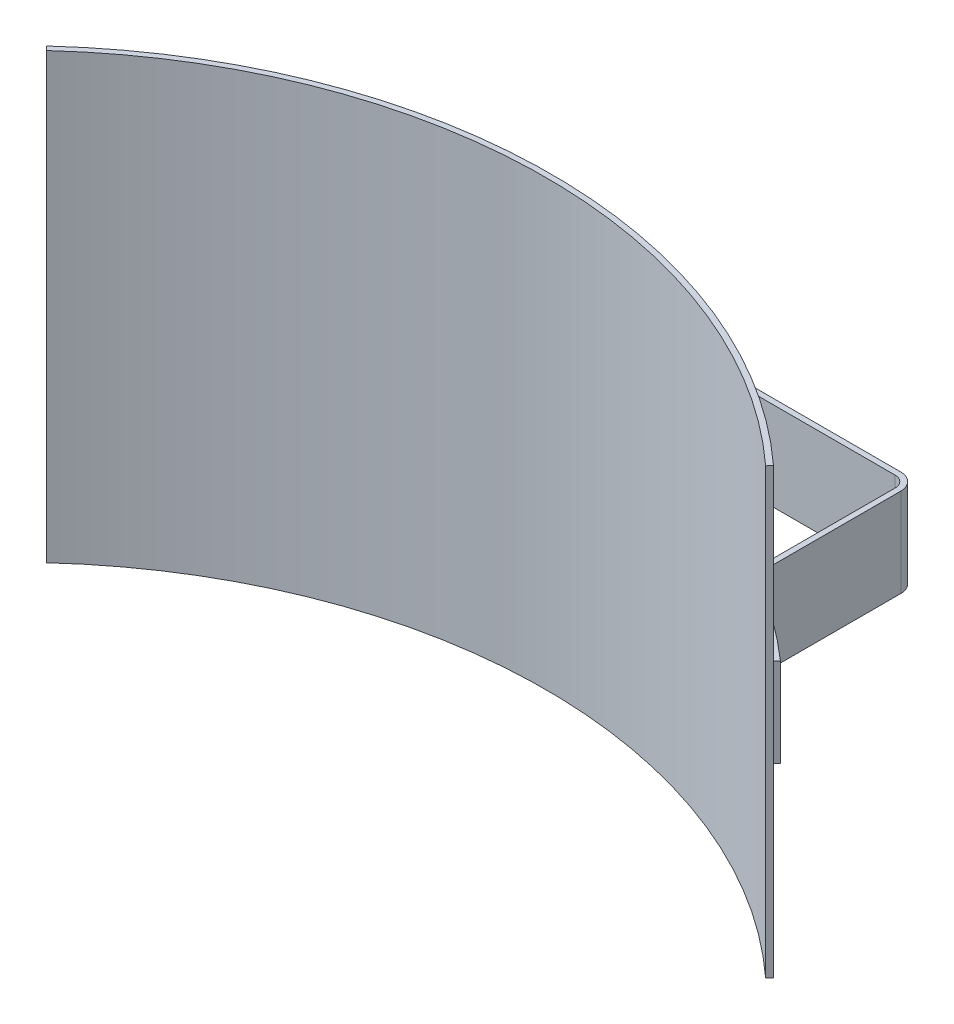
ISO-10303-21;
HEADER;
FILE_DESCRIPTION(('STEP AP214'),'2;1');
FILE_NAME('part.step','',(''),(''),'','','');
FILE_SCHEMA(('AUTOMOTIVE_DESIGN { 1 0 10303 214 1 1 1 1 }'));
ENDSEC;
DATA;
#1=APPLICATION_CONTEXT('core data for automotive mechanical design processes');
#2=APPLICATION_PROTOCOL_DEFINITION('international standard','automotive_design',2000,#1);
#3=PRODUCT_CONTEXT('',#1,'mechanical');
#4=PRODUCT('Part','Part','',(#3));
#5=PRODUCT_RELATED_PRODUCT_CATEGORY('part','',(#4));
#6=PRODUCT_DEFINITION_FORMATION('','',#4);
#7=PRODUCT_DEFINITION_CONTEXT('part definition',#1,'design');
#8=PRODUCT_DEFINITION('design','',#6,#7);
#9=PRODUCT_DEFINITION_SHAPE('','',#8);
#10=(LENGTH_UNIT() NAMED_UNIT(*) SI_UNIT(.MILLI.,.METRE.));
#11=(NAMED_UNIT(*) PLANE_ANGLE_UNIT() SI_UNIT($,.RADIAN.));
#12=(NAMED_UNIT(*) SI_UNIT($,.STERADIAN.) SOLID_ANGLE_UNIT());
#13=UNCERTAINTY_MEASURE_WITH_UNIT(LENGTH_MEASURE(1.E-05),#10,'distance_accuracy_value','');
#14=(GEOMETRIC_REPRESENTATION_CONTEXT(3) GLOBAL_UNCERTAINTY_ASSIGNED_CONTEXT((#13)) GLOBAL_UNIT_ASSIGNED_CONTEXT((#10,
#11,#12)) REPRESENTATION_CONTEXT('',''));
#15=CARTESIAN_POINT('',(0.,0.,0.));
#16=DIRECTION('',(0.,0.,1.));
#17=DIRECTION('',(1.,0.,0.));
#18=AXIS2_PLACEMENT_3D('',#15,#16,#17);
#19=CARTESIAN_POINT('',(0.,63.5,0.));
#20=DIRECTION('',(0.,-1.,0.));
#21=DIRECTION('',(0.,0.,-1.));
#22=AXIS2_PLACEMENT_3D('',#19,#20,#21);
#23=CYLINDRICAL_SURFACE('',#22,153.9875);
#24=DIRECTION('',(0.,-1.,0.));
#25=VECTOR('',#24,1.);
#26=CARTESIAN_POINT('',(101.6,12.7,-115.713396615301));
#27=LINE('',#26,#25);
#28=CARTESIAN_POINT('',(101.6,12.7,-115.713396615301));
#29=VERTEX_POINT('',#28);
#30=CARTESIAN_POINT('',(101.6,-12.7,-115.713396615301));
#31=VERTEX_POINT('',#30);
#32=EDGE_CURVE('E54',#29,#31,#27,.T.);
#33=ORIENTED_EDGE('',*,*,#32,.F.);
#34=CARTESIAN_POINT('',(0.,12.7,0.));
#35=DIRECTION('',(0.,-1.,0.));
#36=DIRECTION('',(0.,0.,-1.));
#37=AXIS2_PLACEMENT_3D('',#34,#35,#36);
#38=CIRCLE('',#37,153.9875);
#39=CARTESIAN_POINT('',(77.7714646464647,12.7,-132.905039193379));
#40=VERTEX_POINT('',#39);
#41=EDGE_CURVE('E49',#40,#29,#38,.T.);
#42=ORIENTED_EDGE('',*,*,#41,.F.);
#43=DIRECTION('',(0.,-1.,0.));
#44=VECTOR('',#43,1.);
#45=CARTESIAN_POINT('',(77.7714646464646,12.7,-132.905039193379));
#46=LINE('',#45,#44);
#47=CARTESIAN_POINT('',(77.7714646464646,-12.7,-132.905039193379));
#48=VERTEX_POINT('',#47);
#49=EDGE_CURVE('E327',#40,#48,#46,.T.);
#50=ORIENTED_EDGE('',*,*,#49,.T.);
#51=CARTESIAN_POINT('',(0.,-12.7,0.));
#52=DIRECTION('',(0.,-1.,0.));
#53=DIRECTION('',(0.,0.,-1.));
#54=AXIS2_PLACEMENT_3D('',#51,#52,#53);
#55=CIRCLE('',#54,153.9875);
#56=EDGE_CURVE('E270',#48,#31,#55,.T.);
#57=ORIENTED_EDGE('',*,*,#56,.T.);
#58=EDGE_LOOP('',(#33,#42,#50,#57));
#59=FACE_BOUND('',#58,.T.);
#60=DIRECTION('',(0.,-1.,0.));
#61=VECTOR('',#60,1.);
#62=CARTESIAN_POINT('',(-77.7714646464646,12.7,-132.905039193379));
#63=LINE('',#62,#61);
#64=CARTESIAN_POINT('',(-77.7714646464647,12.7,-132.905039193379));
#65=VERTEX_POINT('',#64);
#66=CARTESIAN_POINT('',(-77.7714646464646,-12.7,-132.905039193379));
#67=VERTEX_POINT('',#66);
#68=EDGE_CURVE('E211',#65,#67,#63,.T.);
#69=ORIENTED_EDGE('',*,*,#68,.F.);
#70=CARTESIAN_POINT('',(0.,12.7,0.));
#71=DIRECTION('',(0.,-1.,0.));
#72=DIRECTION('',(0.,0.,1.));
#73=AXIS2_PLACEMENT_3D('',#70,#71,#72);
#74=CIRCLE('',#73,153.9875);
#75=CARTESIAN_POINT('',(-101.6,12.7,-115.713396615301));
#76=VERTEX_POINT('',#75);
#77=EDGE_CURVE('E200',#76,#65,#74,.T.);
#78=ORIENTED_EDGE('',*,*,#77,.F.);
#79=DIRECTION('',(0.,-1.,0.));
#80=VECTOR('',#79,1.);
#81=CARTESIAN_POINT('',(-101.6,12.7,-115.713396615301));
#82=LINE('',#81,#80);
#83=CARTESIAN_POINT('',(-101.6,-12.7,-115.713396615301));
#84=VERTEX_POINT('',#83);
#85=EDGE_CURVE('E253',#76,#84,#82,.T.);
#86=ORIENTED_EDGE('',*,*,#85,.T.);
#87=CARTESIAN_POINT('',(0.,-12.7,0.));
#88=DIRECTION('',(0.,-1.,0.));
#89=DIRECTION('',(0.,0.,1.));
#90=AXIS2_PLACEMENT_3D('',#87,#88,#89);
#91=CIRCLE('',#90,153.9875);
#92=EDGE_CURVE('E254',#84,#67,#91,.T.);
#93=ORIENTED_EDGE('',*,*,#92,.T.);
#94=EDGE_LOOP('',(#69,#78,#86,#93));
#95=FACE_BOUND('',#94,.T.);
#96=CARTESIAN_POINT('',(0.,-63.5,0.));
#97=DIRECTION('',(0.,1.,0.));
#98=DIRECTION('',(0.,0.,1.));
#99=AXIS2_PLACEMENT_3D('',#96,#97,#98);
#100=CIRCLE('',#99,153.9875);
#101=CARTESIAN_POINT('',(104.032447095217,-63.5,-113.531493902049));
#102=VERTEX_POINT('',#101);
#103=CARTESIAN_POINT('',(-104.032447095217,-63.5,-113.531493902049));
#104=VERTEX_POINT('',#103);
#105=EDGE_CURVE('E343',#102,#104,#100,.T.);
#106=ORIENTED_EDGE('',*,*,#105,.T.);
#107=DIRECTION('',(0.,-1.,0.));
#108=VECTOR('',#107,1.);
#109=CARTESIAN_POINT('',(-104.032447095217,63.5,-113.531493902049));
#110=LINE('',#109,#108);
#111=CARTESIAN_POINT('',(-104.032447095217,63.5,-113.531493902049));
#112=VERTEX_POINT('',#111);
#113=EDGE_CURVE('E11',#112,#104,#110,.T.);
#114=ORIENTED_EDGE('',*,*,#113,.F.);
#115=CARTESIAN_POINT('',(0.,63.5,0.));
#116=DIRECTION('',(0.,1.,0.));
#117=DIRECTION('',(0.,0.,1.));
#118=AXIS2_PLACEMENT_3D('',#115,#116,#117);
#119=CIRCLE('',#118,153.9875);
#120=CARTESIAN_POINT('',(104.032447095217,63.5,-113.531493902049));
#121=VERTEX_POINT('',#120);
#122=EDGE_CURVE('E344',#121,#112,#119,.T.);
#123=ORIENTED_EDGE('',*,*,#122,.F.);
#124=DIRECTION('',(0.,-1.,0.));
#125=VECTOR('',#124,1.);
#126=CARTESIAN_POINT('',(104.032447095217,63.5,-113.531493902049));
#127=LINE('',#126,#125);
#128=EDGE_CURVE('E354',#121,#102,#127,.T.);
#129=ORIENTED_EDGE('',*,*,#128,.T.);
#130=EDGE_LOOP('',(#106,#114,#123,#129));
#131=FACE_BOUND('',#130,.T.);
#132=ADVANCED_FACE('F35',(#59,#95,#131),#23,.T.);
#133=CARTESIAN_POINT('',(-104.032447095217,63.5,-113.531493902049));
#134=DIRECTION('',(0.73727733681012,0.,-0.675590207615665));
#135=DIRECTION('',(-0.675590207615665,0.,-0.73727733681012));
#136=AXIS2_PLACEMENT_3D('',#133,#134,#135);
#137=PLANE('',#136);
#138=DIRECTION('',(0.675590207615665,0.,0.73727733681012));
#139=VECTOR('',#138,1.);
#140=CARTESIAN_POINT('',(-104.032447095217,-63.5,-113.531493902049));
#141=LINE('',#140,#139);
#142=CARTESIAN_POINT('',(-102.959947640627,-63.5,-112.361066129863));
#143=VERTEX_POINT('',#142);
#144=EDGE_CURVE('E357',#104,#143,#141,.T.);
#145=ORIENTED_EDGE('',*,*,#144,.T.);
#146=DIRECTION('',(0.,-1.,0.));
#147=VECTOR('',#146,1.);
#148=CARTESIAN_POINT('',(-102.959947640627,63.5,-112.361066129863));
#149=LINE('',#148,#147);
#150=CARTESIAN_POINT('',(-102.959947640627,63.5,-112.361066129863));
#151=VERTEX_POINT('',#150);
#152=EDGE_CURVE('E42',#151,#143,#149,.T.);
#153=ORIENTED_EDGE('',*,*,#152,.F.);
#154=DIRECTION('',(0.675590207615665,0.,0.73727733681012));
#155=VECTOR('',#154,1.);
#156=CARTESIAN_POINT('',(-104.032447095217,63.5,-113.531493902049));
#157=LINE('',#156,#155);
#158=EDGE_CURVE('E347',#112,#151,#157,.T.);
#159=ORIENTED_EDGE('',*,*,#158,.F.);
#160=ORIENTED_EDGE('',*,*,#113,.T.);
#161=EDGE_LOOP('',(#145,#153,#159,#160));
#162=FACE_BOUND('',#161,.T.);
#163=ADVANCED_FACE('F387',(#162),#137,.F.);
#164=CARTESIAN_POINT('',(0.,63.5,0.));
#165=DIRECTION('',(0.,-1.,0.));
#166=DIRECTION('',(0.,0.,-1.));
#167=AXIS2_PLACEMENT_3D('',#164,#165,#166);
#168=CYLINDRICAL_SURFACE('',#167,152.4);
#169=CARTESIAN_POINT('',(0.,-63.5,0.));
#170=DIRECTION('',(0.,-1.,0.));
#171=DIRECTION('',(0.,0.,1.));
#172=AXIS2_PLACEMENT_3D('',#169,#170,#171);
#173=CIRCLE('',#172,152.4);
#174=CARTESIAN_POINT('',(102.959947640627,-63.5,-112.361066129863));
#175=VERTEX_POINT('',#174);
#176=EDGE_CURVE('E359',#143,#175,#173,.T.);
#177=ORIENTED_EDGE('',*,*,#176,.T.);
#178=DIRECTION('',(0.,-1.,0.));
#179=VECTOR('',#178,1.);
#180=CARTESIAN_POINT('',(102.959947640627,63.5,-112.361066129863));
#181=LINE('',#180,#179);
#182=CARTESIAN_POINT('',(102.959947640627,63.5,-112.361066129863));
#183=VERTEX_POINT('',#182);
#184=EDGE_CURVE('E364',#183,#175,#181,.T.);
#185=ORIENTED_EDGE('',*,*,#184,.F.);
#186=CARTESIAN_POINT('',(0.,63.5,0.));
#187=DIRECTION('',(0.,-1.,0.));
#188=DIRECTION('',(0.,0.,1.));
#189=AXIS2_PLACEMENT_3D('',#186,#187,#188);
#190=CIRCLE('',#189,152.4);
#191=EDGE_CURVE('E350',#151,#183,#190,.T.);
#192=ORIENTED_EDGE('',*,*,#191,.F.);
#193=ORIENTED_EDGE('',*,*,#152,.T.);
#194=EDGE_LOOP('',(#177,#185,#192,#193));
#195=FACE_BOUND('',#194,.T.);
#196=ADVANCED_FACE('F371',(#195),#168,.F.);
#197=CARTESIAN_POINT('',(104.032447095217,63.5,-113.531493902049));
#198=DIRECTION('',(-0.737277336810124,0.,-0.67559020761566));
#199=DIRECTION('',(-0.67559020761566,0.,0.737277336810124));
#200=AXIS2_PLACEMENT_3D('',#197,#198,#199);
#201=PLANE('',#200);
#202=DIRECTION('',(0.67559020761566,0.,-0.737277336810124));
#203=VECTOR('',#202,1.);
#204=CARTESIAN_POINT('',(104.032447095217,-63.5,-113.531493902049));
#205=LINE('',#204,#203);
#206=EDGE_CURVE('E348',#175,#102,#205,.T.);
#207=ORIENTED_EDGE('',*,*,#206,.T.);
#208=ORIENTED_EDGE('',*,*,#128,.F.);
#209=DIRECTION('',(0.67559020761566,0.,-0.737277336810124));
#210=VECTOR('',#209,1.);
#211=CARTESIAN_POINT('',(104.032447095217,63.5,-113.531493902049));
#212=LINE('',#211,#210);
#213=EDGE_CURVE('E352',#183,#121,#212,.T.);
#214=ORIENTED_EDGE('',*,*,#213,.F.);
#215=ORIENTED_EDGE('',*,*,#184,.T.);
#216=EDGE_LOOP('',(#207,#208,#214,#215));
#217=FACE_BOUND('',#216,.T.);
#218=ADVANCED_FACE('F380',(#217),#201,.F.);
#219=CARTESIAN_POINT('',(0.,63.5,0.));
#220=DIRECTION('',(0.,1.,0.));
#221=DIRECTION('',(0.,0.,1.));
#222=AXIS2_PLACEMENT_3D('',#219,#220,#221);
#223=PLANE('',#222);
#224=ORIENTED_EDGE('',*,*,#122,.T.);
#225=ORIENTED_EDGE('',*,*,#158,.T.);
#226=ORIENTED_EDGE('',*,*,#191,.T.);
#227=ORIENTED_EDGE('',*,*,#213,.T.);
#228=EDGE_LOOP('',(#224,#225,#226,#227));
#229=FACE_BOUND('',#228,.T.);
#230=ADVANCED_FACE('F386',(#229),#223,.T.);
#231=CARTESIAN_POINT('',(0.,-63.5,0.));
#232=DIRECTION('',(0.,1.,0.));
#233=DIRECTION('',(0.,0.,1.));
#234=AXIS2_PLACEMENT_3D('',#231,#232,#233);
#235=PLANE('',#234);
#236=ORIENTED_EDGE('',*,*,#105,.F.);
#237=ORIENTED_EDGE('',*,*,#206,.F.);
#238=ORIENTED_EDGE('',*,*,#176,.F.);
#239=ORIENTED_EDGE('',*,*,#144,.F.);
#240=EDGE_LOOP('',(#236,#237,#238,#239));
#241=FACE_BOUND('',#240,.T.);
#242=ADVANCED_FACE('F377',(#241),#235,.F.);
#243=CARTESIAN_POINT('',(-79.375,12.7,-135.645349279841));
#244=DIRECTION('',(0.,-1.,0.));
#245=DIRECTION('',(0.,0.,-1.));
#246=AXIS2_PLACEMENT_3D('',#243,#244,#245);
#247=CYLINDRICAL_SURFACE('',#246,3.17500000000001);
#248=CARTESIAN_POINT('',(-79.375,-12.7,-135.645349279841));
#249=DIRECTION('',(0.,1.,0.));
#250=DIRECTION('',(0.,0.,-1.));
#251=AXIS2_PLACEMENT_3D('',#248,#249,#250);
#252=CIRCLE('',#251,3.17500000000001);
#253=CARTESIAN_POINT('',(-76.2,-12.7,-135.645349279841));
#254=VERTEX_POINT('',#253);
#255=EDGE_CURVE('E208',#67,#254,#252,.T.);
#256=ORIENTED_EDGE('',*,*,#255,.T.);
#257=DIRECTION('',(0.,-1.,0.));
#258=VECTOR('',#257,1.);
#259=CARTESIAN_POINT('',(-76.2,12.7,-135.645349279841));
#260=LINE('',#259,#258);
#261=CARTESIAN_POINT('',(-76.2,12.7,-135.645349279841));
#262=VERTEX_POINT('',#261);
#263=EDGE_CURVE('E205',#262,#254,#260,.T.);
#264=ORIENTED_EDGE('',*,*,#263,.F.);
#265=CARTESIAN_POINT('',(-79.375,12.7,-135.645349279841));
#266=DIRECTION('',(0.,1.,0.));
#267=DIRECTION('',(0.,0.,-1.));
#268=AXIS2_PLACEMENT_3D('',#265,#266,#267);
#269=CIRCLE('',#268,3.17500000000001);
#270=EDGE_CURVE('E193',#65,#262,#269,.T.);
#271=ORIENTED_EDGE('',*,*,#270,.F.);
#272=ORIENTED_EDGE('',*,*,#68,.T.);
#273=EDGE_LOOP('',(#256,#264,#271,#272));
#274=FACE_BOUND('',#273,.T.);
#275=ADVANCED_FACE('F206',(#274),#247,.T.);
#276=CARTESIAN_POINT('',(-76.2,12.7,-176.2125));
#277=DIRECTION('',(-1.,0.,0.));
#278=DIRECTION('',(0.,0.,1.));
#279=AXIS2_PLACEMENT_3D('',#276,#277,#278);
#280=PLANE('',#279);
#281=DIRECTION('',(0.,0.,-1.));
#282=VECTOR('',#281,1.);
#283=CARTESIAN_POINT('',(-76.2,-12.7,-176.2125));
#284=LINE('',#283,#282);
#285=CARTESIAN_POINT('',(-76.2,-12.7,-176.2125));
#286=VERTEX_POINT('',#285);
#287=EDGE_CURVE('E257',#254,#286,#284,.T.);
#288=ORIENTED_EDGE('',*,*,#287,.T.);
#289=DIRECTION('',(0.,-1.,0.));
#290=VECTOR('',#289,1.);
#291=CARTESIAN_POINT('',(-76.2,12.7,-176.2125));
#292=LINE('',#291,#290);
#293=CARTESIAN_POINT('',(-76.2,12.7,-176.2125));
#294=VERTEX_POINT('',#293);
#295=EDGE_CURVE('E212',#294,#286,#292,.T.);
#296=ORIENTED_EDGE('',*,*,#295,.F.);
#297=DIRECTION('',(0.,0.,-1.));
#298=VECTOR('',#297,1.);
#299=CARTESIAN_POINT('',(-76.2,12.7,-176.2125));
#300=LINE('',#299,#298);
#301=EDGE_CURVE('E197',#262,#294,#300,.T.);
#302=ORIENTED_EDGE('',*,*,#301,.F.);
#303=ORIENTED_EDGE('',*,*,#263,.T.);
#304=EDGE_LOOP('',(#288,#296,#302,#303));
#305=FACE_BOUND('',#304,.T.);
#306=ADVANCED_FACE('F214',(#305),#280,.F.);
#307=CARTESIAN_POINT('',(-73.025,12.7,-176.2125));
#308=DIRECTION('',(0.,-1.,0.));
#309=DIRECTION('',(0.,0.,-1.));
#310=AXIS2_PLACEMENT_3D('',#307,#308,#309);
#311=CYLINDRICAL_SURFACE('',#310,3.175);
#312=CARTESIAN_POINT('',(-73.025,-12.7,-176.2125));
#313=DIRECTION('',(0.,-1.,0.));
#314=DIRECTION('',(0.,0.,-1.));
#315=AXIS2_PLACEMENT_3D('',#312,#313,#314);
#316=CIRCLE('',#315,3.175);
#317=CARTESIAN_POINT('',(-73.025,-12.7,-179.3875));
#318=VERTEX_POINT('',#317);
#319=EDGE_CURVE('E259',#286,#318,#316,.T.);
#320=ORIENTED_EDGE('',*,*,#319,.T.);
#321=DIRECTION('',(0.,-1.,0.));
#322=VECTOR('',#321,1.);
#323=CARTESIAN_POINT('',(-73.025,12.7,-179.3875));
#324=LINE('',#323,#322);
#325=CARTESIAN_POINT('',(-73.025,12.7,-179.3875));
#326=VERTEX_POINT('',#325);
#327=EDGE_CURVE('E338',#326,#318,#324,.T.);
#328=ORIENTED_EDGE('',*,*,#327,.F.);
#329=CARTESIAN_POINT('',(-73.025,12.7,-176.2125));
#330=DIRECTION('',(0.,-1.,0.));
#331=DIRECTION('',(0.,0.,-1.));
#332=AXIS2_PLACEMENT_3D('',#329,#330,#331);
#333=CIRCLE('',#332,3.175);
#334=EDGE_CURVE('E217',#294,#326,#333,.T.);
#335=ORIENTED_EDGE('',*,*,#334,.F.);
#336=ORIENTED_EDGE('',*,*,#295,.T.);
#337=EDGE_LOOP('',(#320,#328,#335,#336));
#338=FACE_BOUND('',#337,.T.);
#339=ADVANCED_FACE('F405',(#338),#311,.F.);
#340=CARTESIAN_POINT('',(73.025,12.7,-179.3875));
#341=DIRECTION('',(0.,0.,-1.));
#342=DIRECTION('',(-1.,0.,0.));
#343=AXIS2_PLACEMENT_3D('',#340,#341,#342);
#344=PLANE('',#343);
#345=DIRECTION('',(1.,0.,0.));
#346=VECTOR('',#345,1.);
#347=CARTESIAN_POINT('',(73.025,-12.7,-179.3875));
#348=LINE('',#347,#346);
#349=CARTESIAN_POINT('',(73.025,-12.7,-179.3875));
#350=VERTEX_POINT('',#349);
#351=EDGE_CURVE('E261',#318,#350,#348,.T.);
#352=ORIENTED_EDGE('',*,*,#351,.T.);
#353=DIRECTION('',(0.,-1.,0.));
#354=VECTOR('',#353,1.);
#355=CARTESIAN_POINT('',(73.025,12.7,-179.3875));
#356=LINE('',#355,#354);
#357=CARTESIAN_POINT('',(73.025,12.7,-179.3875));
#358=VERTEX_POINT('',#357);
#359=EDGE_CURVE('E335',#358,#350,#356,.T.);
#360=ORIENTED_EDGE('',*,*,#359,.F.);
#361=DIRECTION('',(1.,0.,0.));
#362=VECTOR('',#361,1.);
#363=CARTESIAN_POINT('',(73.025,12.7,-179.3875));
#364=LINE('',#363,#362);
#365=EDGE_CURVE('E219',#326,#358,#364,.T.);
#366=ORIENTED_EDGE('',*,*,#365,.F.);
#367=ORIENTED_EDGE('',*,*,#327,.T.);
#368=EDGE_LOOP('',(#352,#360,#366,#367));
#369=FACE_BOUND('',#368,.T.);
#370=ADVANCED_FACE('F408',(#369),#344,.F.);
#371=CARTESIAN_POINT('',(73.025,12.7,-176.2125));
#372=DIRECTION('',(0.,-1.,0.));
#373=DIRECTION('',(0.,0.,-1.));
#374=AXIS2_PLACEMENT_3D('',#371,#372,#373);
#375=CYLINDRICAL_SURFACE('',#374,3.175);
#376=CARTESIAN_POINT('',(73.025,-12.7,-176.2125));
#377=DIRECTION('',(0.,-1.,0.));
#378=DIRECTION('',(0.,0.,1.));
#379=AXIS2_PLACEMENT_3D('',#376,#377,#378);
#380=CIRCLE('',#379,3.175);
#381=CARTESIAN_POINT('',(76.2,-12.7,-176.2125));
#382=VERTEX_POINT('',#381);
#383=EDGE_CURVE('E263',#350,#382,#380,.T.);
#384=ORIENTED_EDGE('',*,*,#383,.T.);
#385=DIRECTION('',(0.,-1.,0.));
#386=VECTOR('',#385,1.);
#387=CARTESIAN_POINT('',(76.2,12.7,-176.2125));
#388=LINE('',#387,#386);
#389=CARTESIAN_POINT('',(76.2,12.7,-176.2125));
#390=VERTEX_POINT('',#389);
#391=EDGE_CURVE('E332',#390,#382,#388,.T.);
#392=ORIENTED_EDGE('',*,*,#391,.F.);
#393=CARTESIAN_POINT('',(73.025,12.7,-176.2125));
#394=DIRECTION('',(0.,-1.,0.));
#395=DIRECTION('',(0.,0.,1.));
#396=AXIS2_PLACEMENT_3D('',#393,#394,#395);
#397=CIRCLE('',#396,3.175);
#398=EDGE_CURVE('E224',#358,#390,#397,.T.);
#399=ORIENTED_EDGE('',*,*,#398,.F.);
#400=ORIENTED_EDGE('',*,*,#359,.T.);
#401=EDGE_LOOP('',(#384,#392,#399,#400));
#402=FACE_BOUND('',#401,.T.);
#403=ADVANCED_FACE('F412',(#402),#375,.F.);
#404=CARTESIAN_POINT('',(76.2,12.7,-176.2125));
#405=DIRECTION('',(1.,0.,0.));
#406=DIRECTION('',(0.,0.,-1.));
#407=AXIS2_PLACEMENT_3D('',#404,#405,#406);
#408=PLANE('',#407);
#409=DIRECTION('',(0.,0.,1.));
#410=VECTOR('',#409,1.);
#411=CARTESIAN_POINT('',(76.2,-12.7,-176.2125));
#412=LINE('',#411,#410);
#413=CARTESIAN_POINT('',(76.2,-12.7,-135.645349279841));
#414=VERTEX_POINT('',#413);
#415=EDGE_CURVE('E265',#382,#414,#412,.T.);
#416=ORIENTED_EDGE('',*,*,#415,.T.);
#417=DIRECTION('',(0.,-1.,0.));
#418=VECTOR('',#417,1.);
#419=CARTESIAN_POINT('',(76.2,12.7,-135.645349279841));
#420=LINE('',#419,#418);
#421=CARTESIAN_POINT('',(76.2,12.7,-135.645349279841));
#422=VERTEX_POINT('',#421);
#423=EDGE_CURVE('E329',#422,#414,#420,.T.);
#424=ORIENTED_EDGE('',*,*,#423,.F.);
#425=DIRECTION('',(0.,0.,1.));
#426=VECTOR('',#425,1.);
#427=CARTESIAN_POINT('',(76.2,12.7,-176.2125));
#428=LINE('',#427,#426);
#429=EDGE_CURVE('E226',#390,#422,#428,.T.);
#430=ORIENTED_EDGE('',*,*,#429,.F.);
#431=ORIENTED_EDGE('',*,*,#391,.T.);
#432=EDGE_LOOP('',(#416,#424,#430,#431));
#433=FACE_BOUND('',#432,.T.);
#434=ADVANCED_FACE('F416',(#433),#408,.F.);
#435=CARTESIAN_POINT('',(79.375,12.7,-135.645349279841));
#436=DIRECTION('',(0.,-1.,0.));
#437=DIRECTION('',(0.,0.,-1.));
#438=AXIS2_PLACEMENT_3D('',#435,#436,#437);
#439=CYLINDRICAL_SURFACE('',#438,3.17500000000001);
#440=CARTESIAN_POINT('',(79.375,-12.7,-135.645349279841));
#441=DIRECTION('',(0.,1.,0.));
#442=DIRECTION('',(0.,0.,1.));
#443=AXIS2_PLACEMENT_3D('',#440,#441,#442);
#444=CIRCLE('',#443,3.17500000000001);
#445=EDGE_CURVE('E267',#414,#48,#444,.T.);
#446=ORIENTED_EDGE('',*,*,#445,.T.);
#447=ORIENTED_EDGE('',*,*,#49,.F.);
#448=CARTESIAN_POINT('',(79.375,12.7,-135.645349279841));
#449=DIRECTION('',(0.,1.,0.));
#450=DIRECTION('',(0.,0.,1.));
#451=AXIS2_PLACEMENT_3D('',#448,#449,#450);
#452=CIRCLE('',#451,3.17500000000001);
#453=EDGE_CURVE('E228',#422,#40,#452,.T.);
#454=ORIENTED_EDGE('',*,*,#453,.F.);
#455=ORIENTED_EDGE('',*,*,#423,.T.);
#456=EDGE_LOOP('',(#446,#447,#454,#455));
#457=FACE_BOUND('',#456,.T.);
#458=ADVANCED_FACE('F420',(#457),#439,.T.);
#459=CARTESIAN_POINT('',(102.647422680412,12.7,-116.906318229892));
#460=DIRECTION('',(-0.751446686356366,0.,-0.659793814432992));
#461=DIRECTION('',(-0.659793814432992,0.,0.751446686356366));
#462=AXIS2_PLACEMENT_3D('',#459,#460,#461);
#463=PLANE('',#462);
#464=DIRECTION('',(0.659793814432992,0.,-0.751446686356366));
#465=VECTOR('',#464,1.);
#466=CARTESIAN_POINT('',(102.647422680412,-12.7,-116.906318229892));
#467=LINE('',#466,#465);
#468=CARTESIAN_POINT('',(102.647422680412,-12.7,-116.906318229892));
#469=VERTEX_POINT('',#468);
#470=EDGE_CURVE('E272',#31,#469,#467,.T.);
#471=ORIENTED_EDGE('',*,*,#470,.T.);
#472=DIRECTION('',(0.,-1.,0.));
#473=VECTOR('',#472,1.);
#474=CARTESIAN_POINT('',(102.647422680412,12.7,-116.906318229892));
#475=LINE('',#474,#473);
#476=CARTESIAN_POINT('',(102.647422680412,12.7,-116.906318229892));
#477=VERTEX_POINT('',#476);
#478=EDGE_CURVE('E323',#477,#469,#475,.T.);
#479=ORIENTED_EDGE('',*,*,#478,.F.);
#480=DIRECTION('',(0.659793814432992,0.,-0.751446686356366));
#481=VECTOR('',#480,1.);
#482=CARTESIAN_POINT('',(102.647422680412,12.7,-116.906318229892));
#483=LINE('',#482,#481);
#484=EDGE_CURVE('E231',#29,#477,#483,.T.);
#485=ORIENTED_EDGE('',*,*,#484,.F.);
#486=ORIENTED_EDGE('',*,*,#32,.T.);
#487=EDGE_LOOP('',(#471,#479,#485,#486));
#488=FACE_BOUND('',#487,.T.);
#489=ADVANCED_FACE('F424',(#488),#463,.F.);
#490=CARTESIAN_POINT('',(0.,12.7,0.));
#491=DIRECTION('',(0.,-1.,0.));
#492=DIRECTION('',(0.,0.,-1.));
#493=AXIS2_PLACEMENT_3D('',#490,#491,#492);
#494=CYLINDRICAL_SURFACE('',#493,155.575);
#495=CARTESIAN_POINT('',(0.,-12.7,0.));
#496=DIRECTION('',(0.,1.,0.));
#497=DIRECTION('',(0.,0.,-1.));
#498=AXIS2_PLACEMENT_3D('',#495,#496,#497);
#499=CIRCLE('',#498,155.575);
#500=CARTESIAN_POINT('',(78.5732323232323,-12.7,-134.27519423661));
#501=VERTEX_POINT('',#500);
#502=EDGE_CURVE('E274',#469,#501,#499,.T.);
#503=ORIENTED_EDGE('',*,*,#502,.T.);
#504=DIRECTION('',(0.,-1.,0.));
#505=VECTOR('',#504,1.);
#506=CARTESIAN_POINT('',(78.5732323232323,12.7,-134.27519423661));
#507=LINE('',#506,#505);
#508=CARTESIAN_POINT('',(78.5732323232323,12.7,-134.27519423661));
#509=VERTEX_POINT('',#508);
#510=EDGE_CURVE('E320',#509,#501,#507,.T.);
#511=ORIENTED_EDGE('',*,*,#510,.F.);
#512=CARTESIAN_POINT('',(0.,12.7,0.));
#513=DIRECTION('',(0.,1.,0.));
#514=DIRECTION('',(0.,0.,-1.));
#515=AXIS2_PLACEMENT_3D('',#512,#513,#514);
#516=CIRCLE('',#515,155.575);
#517=EDGE_CURVE('E233',#477,#509,#516,.T.);
#518=ORIENTED_EDGE('',*,*,#517,.F.);
#519=ORIENTED_EDGE('',*,*,#478,.T.);
#520=EDGE_LOOP('',(#503,#511,#518,#519));
#521=FACE_BOUND('',#520,.T.);
#522=ADVANCED_FACE('F428',(#521),#494,.T.);
#523=CARTESIAN_POINT('',(79.375,12.7,-135.645349279841));
#524=DIRECTION('',(0.,-1.,0.));
#525=DIRECTION('',(0.,0.,-1.));
#526=AXIS2_PLACEMENT_3D('',#523,#524,#525);
#527=CYLINDRICAL_SURFACE('',#526,1.58750000000002);
#528=CARTESIAN_POINT('',(79.375,-12.7,-135.645349279841));
#529=DIRECTION('',(0.,-1.,0.));
#530=DIRECTION('',(0.,0.,1.));
#531=AXIS2_PLACEMENT_3D('',#528,#529,#530);
#532=CIRCLE('',#531,1.58750000000002);
#533=CARTESIAN_POINT('',(77.7875,-12.7,-135.645349279841));
#534=VERTEX_POINT('',#533);
#535=EDGE_CURVE('E276',#501,#534,#532,.T.);
#536=ORIENTED_EDGE('',*,*,#535,.T.);
#537=DIRECTION('',(0.,-1.,0.));
#538=VECTOR('',#537,1.);
#539=CARTESIAN_POINT('',(77.7875,12.7,-135.645349279841));
#540=LINE('',#539,#538);
#541=CARTESIAN_POINT('',(77.7875,12.7,-135.645349279841));
#542=VERTEX_POINT('',#541);
#543=EDGE_CURVE('E317',#542,#534,#540,.T.);
#544=ORIENTED_EDGE('',*,*,#543,.F.);
#545=CARTESIAN_POINT('',(79.375,12.7,-135.645349279841));
#546=DIRECTION('',(0.,-1.,0.));
#547=DIRECTION('',(0.,0.,1.));
#548=AXIS2_PLACEMENT_3D('',#545,#546,#547);
#549=CIRCLE('',#548,1.58750000000002);
#550=EDGE_CURVE('E235',#509,#542,#549,.T.);
#551=ORIENTED_EDGE('',*,*,#550,.F.);
#552=ORIENTED_EDGE('',*,*,#510,.T.);
#553=EDGE_LOOP('',(#536,#544,#551,#552));
#554=FACE_BOUND('',#553,.T.);
#555=ADVANCED_FACE('F432',(#554),#527,.F.);
#556=CARTESIAN_POINT('',(77.7875,12.7,-176.2125));
#557=DIRECTION('',(-1.,0.,0.));
#558=DIRECTION('',(0.,0.,1.));
#559=AXIS2_PLACEMENT_3D('',#556,#557,#558);
#560=PLANE('',#559);
#561=DIRECTION('',(0.,0.,-1.));
#562=VECTOR('',#561,1.);
#563=CARTESIAN_POINT('',(77.7875,-12.7,-176.2125));
#564=LINE('',#563,#562);
#565=CARTESIAN_POINT('',(77.7875,-12.7,-176.2125));
#566=VERTEX_POINT('',#565);
#567=EDGE_CURVE('E278',#534,#566,#564,.T.);
#568=ORIENTED_EDGE('',*,*,#567,.T.);
#569=DIRECTION('',(0.,-1.,0.));
#570=VECTOR('',#569,1.);
#571=CARTESIAN_POINT('',(77.7875,12.7,-176.2125));
#572=LINE('',#571,#570);
#573=CARTESIAN_POINT('',(77.7875,12.7,-176.2125));
#574=VERTEX_POINT('',#573);
#575=EDGE_CURVE('E314',#574,#566,#572,.T.);
#576=ORIENTED_EDGE('',*,*,#575,.F.);
#577=DIRECTION('',(0.,0.,-1.));
#578=VECTOR('',#577,1.);
#579=CARTESIAN_POINT('',(77.7875,12.7,-176.2125));
#580=LINE('',#579,#578);
#581=EDGE_CURVE('E237',#542,#574,#580,.T.);
#582=ORIENTED_EDGE('',*,*,#581,.F.);
#583=ORIENTED_EDGE('',*,*,#543,.T.);
#584=EDGE_LOOP('',(#568,#576,#582,#583));
#585=FACE_BOUND('',#584,.T.);
#586=ADVANCED_FACE('F436',(#585),#560,.F.);
#587=CARTESIAN_POINT('',(73.025,12.7,-176.2125));
#588=DIRECTION('',(0.,-1.,0.));
#589=DIRECTION('',(0.,0.,-1.));
#590=AXIS2_PLACEMENT_3D('',#587,#588,#589);
#591=CYLINDRICAL_SURFACE('',#590,4.76250000000001);
#592=CARTESIAN_POINT('',(73.025,-12.7,-176.2125));
#593=DIRECTION('',(0.,1.,0.));
#594=DIRECTION('',(0.,0.,1.));
#595=AXIS2_PLACEMENT_3D('',#592,#593,#594);
#596=CIRCLE('',#595,4.76250000000001);
#597=CARTESIAN_POINT('',(73.025,-12.7,-180.975));
#598=VERTEX_POINT('',#597);
#599=EDGE_CURVE('E280',#566,#598,#596,.T.);
#600=ORIENTED_EDGE('',*,*,#599,.T.);
#601=DIRECTION('',(0.,-1.,0.));
#602=VECTOR('',#601,1.);
#603=CARTESIAN_POINT('',(73.025,12.7,-180.975));
#604=LINE('',#603,#602);
#605=CARTESIAN_POINT('',(73.025,12.7,-180.975));
#606=VERTEX_POINT('',#605);
#607=EDGE_CURVE('E311',#606,#598,#604,.T.);
#608=ORIENTED_EDGE('',*,*,#607,.F.);
#609=CARTESIAN_POINT('',(73.025,12.7,-176.2125));
#610=DIRECTION('',(0.,1.,0.));
#611=DIRECTION('',(0.,0.,1.));
#612=AXIS2_PLACEMENT_3D('',#609,#610,#611);
#613=CIRCLE('',#612,4.76250000000001);
#614=EDGE_CURVE('E239',#574,#606,#613,.T.);
#615=ORIENTED_EDGE('',*,*,#614,.F.);
#616=ORIENTED_EDGE('',*,*,#575,.T.);
#617=EDGE_LOOP('',(#600,#608,#615,#616));
#618=FACE_BOUND('',#617,.T.);
#619=ADVANCED_FACE('F440',(#618),#591,.T.);
#620=CARTESIAN_POINT('',(73.025,12.7,-180.975));
#621=DIRECTION('',(0.,0.,1.));
#622=DIRECTION('',(1.,0.,0.));
#623=AXIS2_PLACEMENT_3D('',#620,#621,#622);
#624=PLANE('',#623);
#625=DIRECTION('',(-1.,0.,0.));
#626=VECTOR('',#625,1.);
#627=CARTESIAN_POINT('',(73.025,-12.7,-180.975));
#628=LINE('',#627,#626);
#629=CARTESIAN_POINT('',(-73.025,-12.7,-180.975));
#630=VERTEX_POINT('',#629);
#631=EDGE_CURVE('E282',#598,#630,#628,.T.);
#632=ORIENTED_EDGE('',*,*,#631,.T.);
#633=DIRECTION('',(0.,-1.,0.));
#634=VECTOR('',#633,1.);
#635=CARTESIAN_POINT('',(-73.025,12.7,-180.975));
#636=LINE('',#635,#634);
#637=CARTESIAN_POINT('',(-73.025,12.7,-180.975));
#638=VERTEX_POINT('',#637);
#639=EDGE_CURVE('E308',#638,#630,#636,.T.);
#640=ORIENTED_EDGE('',*,*,#639,.F.);
#641=DIRECTION('',(-1.,0.,0.));
#642=VECTOR('',#641,1.);
#643=CARTESIAN_POINT('',(73.025,12.7,-180.975));
#644=LINE('',#643,#642);
#645=EDGE_CURVE('E241',#606,#638,#644,.T.);
#646=ORIENTED_EDGE('',*,*,#645,.F.);
#647=ORIENTED_EDGE('',*,*,#607,.T.);
#648=EDGE_LOOP('',(#632,#640,#646,#647));
#649=FACE_BOUND('',#648,.T.);
#650=ADVANCED_FACE('F444',(#649),#624,.F.);
#651=CARTESIAN_POINT('',(-73.025,12.7,-176.2125));
#652=DIRECTION('',(0.,-1.,0.));
#653=DIRECTION('',(0.,0.,-1.));
#654=AXIS2_PLACEMENT_3D('',#651,#652,#653);
#655=CYLINDRICAL_SURFACE('',#654,4.76250000000001);
#656=CARTESIAN_POINT('',(-73.025,-12.7,-176.2125));
#657=DIRECTION('',(0.,1.,0.));
#658=DIRECTION('',(0.,0.,-1.));
#659=AXIS2_PLACEMENT_3D('',#656,#657,#658);
#660=CIRCLE('',#659,4.76250000000001);
#661=CARTESIAN_POINT('',(-77.7875,-12.7,-176.2125));
#662=VERTEX_POINT('',#661);
#663=EDGE_CURVE('E284',#630,#662,#660,.T.);
#664=ORIENTED_EDGE('',*,*,#663,.T.);
#665=DIRECTION('',(0.,-1.,0.));
#666=VECTOR('',#665,1.);
#667=CARTESIAN_POINT('',(-77.7875,12.7,-176.2125));
#668=LINE('',#667,#666);
#669=CARTESIAN_POINT('',(-77.7875,12.7,-176.2125));
#670=VERTEX_POINT('',#669);
#671=EDGE_CURVE('E305',#670,#662,#668,.T.);
#672=ORIENTED_EDGE('',*,*,#671,.F.);
#673=CARTESIAN_POINT('',(-73.025,12.7,-176.2125));
#674=DIRECTION('',(0.,1.,0.));
#675=DIRECTION('',(0.,0.,-1.));
#676=AXIS2_PLACEMENT_3D('',#673,#674,#675);
#677=CIRCLE('',#676,4.76250000000001);
#678=EDGE_CURVE('E243',#638,#670,#677,.T.);
#679=ORIENTED_EDGE('',*,*,#678,.F.);
#680=ORIENTED_EDGE('',*,*,#639,.T.);
#681=EDGE_LOOP('',(#664,#672,#679,#680));
#682=FACE_BOUND('',#681,.T.);
#683=ADVANCED_FACE('F448',(#682),#655,.T.);
#684=CARTESIAN_POINT('',(-77.7875,12.7,-176.2125));
#685=DIRECTION('',(1.,0.,0.));
#686=DIRECTION('',(0.,0.,-1.));
#687=AXIS2_PLACEMENT_3D('',#684,#685,#686);
#688=PLANE('',#687);
#689=DIRECTION('',(0.,0.,1.));
#690=VECTOR('',#689,1.);
#691=CARTESIAN_POINT('',(-77.7875,-12.7,-176.2125));
#692=LINE('',#691,#690);
#693=CARTESIAN_POINT('',(-77.7875,-12.7,-135.645349279841));
#694=VERTEX_POINT('',#693);
#695=EDGE_CURVE('E286',#662,#694,#692,.T.);
#696=ORIENTED_EDGE('',*,*,#695,.T.);
#697=DIRECTION('',(0.,-1.,0.));
#698=VECTOR('',#697,1.);
#699=CARTESIAN_POINT('',(-77.7875,12.7,-135.645349279841));
#700=LINE('',#699,#698);
#701=CARTESIAN_POINT('',(-77.7875,12.7,-135.645349279841));
#702=VERTEX_POINT('',#701);
#703=EDGE_CURVE('E302',#702,#694,#700,.T.);
#704=ORIENTED_EDGE('',*,*,#703,.F.);
#705=DIRECTION('',(0.,0.,1.));
#706=VECTOR('',#705,1.);
#707=CARTESIAN_POINT('',(-77.7875,12.7,-176.2125));
#708=LINE('',#707,#706);
#709=EDGE_CURVE('E245',#670,#702,#708,.T.);
#710=ORIENTED_EDGE('',*,*,#709,.F.);
#711=ORIENTED_EDGE('',*,*,#671,.T.);
#712=EDGE_LOOP('',(#696,#704,#710,#711));
#713=FACE_BOUND('',#712,.T.);
#714=ADVANCED_FACE('F452',(#713),#688,.F.);
#715=CARTESIAN_POINT('',(-79.375,12.7,-135.645349279841));
#716=DIRECTION('',(0.,-1.,0.));
#717=DIRECTION('',(0.,0.,-1.));
#718=AXIS2_PLACEMENT_3D('',#715,#716,#717);
#719=CYLINDRICAL_SURFACE('',#718,1.58749999999999);
#720=CARTESIAN_POINT('',(-79.375,-12.7,-135.645349279841));
#721=DIRECTION('',(0.,-1.,0.));
#722=DIRECTION('',(0.,0.,-1.));
#723=AXIS2_PLACEMENT_3D('',#720,#721,#722);
#724=CIRCLE('',#723,1.58749999999999);
#725=CARTESIAN_POINT('',(-78.5732323232323,-12.7,-134.27519423661));
#726=VERTEX_POINT('',#725);
#727=EDGE_CURVE('E288',#694,#726,#724,.T.);
#728=ORIENTED_EDGE('',*,*,#727,.T.);
#729=DIRECTION('',(0.,-1.,0.));
#730=VECTOR('',#729,1.);
#731=CARTESIAN_POINT('',(-78.5732323232323,12.7,-134.27519423661));
#732=LINE('',#731,#730);
#733=CARTESIAN_POINT('',(-78.5732323232323,12.7,-134.27519423661));
#734=VERTEX_POINT('',#733);
#735=EDGE_CURVE('E299',#734,#726,#732,.T.);
#736=ORIENTED_EDGE('',*,*,#735,.F.);
#737=CARTESIAN_POINT('',(-79.375,12.7,-135.645349279841));
#738=DIRECTION('',(0.,-1.,0.));
#739=DIRECTION('',(0.,0.,-1.));
#740=AXIS2_PLACEMENT_3D('',#737,#738,#739);
#741=CIRCLE('',#740,1.58749999999999);
#742=EDGE_CURVE('E247',#702,#734,#741,.T.);
#743=ORIENTED_EDGE('',*,*,#742,.F.);
#744=ORIENTED_EDGE('',*,*,#703,.T.);
#745=EDGE_LOOP('',(#728,#736,#743,#744));
#746=FACE_BOUND('',#745,.T.);
#747=ADVANCED_FACE('F456',(#746),#719,.F.);
#748=CARTESIAN_POINT('',(0.,12.7,0.));
#749=DIRECTION('',(0.,-1.,0.));
#750=DIRECTION('',(0.,0.,-1.));
#751=AXIS2_PLACEMENT_3D('',#748,#749,#750);
#752=CYLINDRICAL_SURFACE('',#751,155.575);
#753=CARTESIAN_POINT('',(0.,-12.7,0.));
#754=DIRECTION('',(0.,1.,0.));
#755=DIRECTION('',(0.,0.,1.));
#756=AXIS2_PLACEMENT_3D('',#753,#754,#755);
#757=CIRCLE('',#756,155.575);
#758=CARTESIAN_POINT('',(-102.647422680412,-12.7,-116.906318229892));
#759=VERTEX_POINT('',#758);
#760=EDGE_CURVE('E290',#726,#759,#757,.T.);
#761=ORIENTED_EDGE('',*,*,#760,.T.);
#762=DIRECTION('',(0.,-1.,0.));
#763=VECTOR('',#762,1.);
#764=CARTESIAN_POINT('',(-102.647422680412,12.7,-116.906318229892));
#765=LINE('',#764,#763);
#766=CARTESIAN_POINT('',(-102.647422680412,12.7,-116.906318229892));
#767=VERTEX_POINT('',#766);
#768=EDGE_CURVE('E296',#767,#759,#765,.T.);
#769=ORIENTED_EDGE('',*,*,#768,.F.);
#770=CARTESIAN_POINT('',(0.,12.7,0.));
#771=DIRECTION('',(0.,1.,0.));
#772=DIRECTION('',(0.,0.,1.));
#773=AXIS2_PLACEMENT_3D('',#770,#771,#772);
#774=CIRCLE('',#773,155.575);
#775=EDGE_CURVE('E249',#734,#767,#774,.T.);
#776=ORIENTED_EDGE('',*,*,#775,.F.);
#777=ORIENTED_EDGE('',*,*,#735,.T.);
#778=EDGE_LOOP('',(#761,#769,#776,#777));
#779=FACE_BOUND('',#778,.T.);
#780=ADVANCED_FACE('F460',(#779),#752,.T.);
#781=CARTESIAN_POINT('',(-102.647422680412,12.7,-116.906318229892));
#782=DIRECTION('',(0.751446686356357,0.,-0.659793814433002));
#783=DIRECTION('',(-0.659793814433002,0.,-0.751446686356357));
#784=AXIS2_PLACEMENT_3D('',#781,#782,#783);
#785=PLANE('',#784);
#786=DIRECTION('',(0.659793814433002,0.,0.751446686356357));
#787=VECTOR('',#786,1.);
#788=CARTESIAN_POINT('',(-102.647422680412,-12.7,-116.906318229892));
#789=LINE('',#788,#787);
#790=EDGE_CURVE('E292',#759,#84,#789,.T.);
#791=ORIENTED_EDGE('',*,*,#790,.T.);
#792=ORIENTED_EDGE('',*,*,#85,.F.);
#793=DIRECTION('',(0.659793814433002,0.,0.751446686356357));
#794=VECTOR('',#793,1.);
#795=CARTESIAN_POINT('',(-102.647422680412,12.7,-116.906318229892));
#796=LINE('',#795,#794);
#797=EDGE_CURVE('E251',#767,#76,#796,.T.);
#798=ORIENTED_EDGE('',*,*,#797,.F.);
#799=ORIENTED_EDGE('',*,*,#768,.T.);
#800=EDGE_LOOP('',(#791,#792,#798,#799));
#801=FACE_BOUND('',#800,.T.);
#802=ADVANCED_FACE('F464',(#801),#785,.F.);
#803=CARTESIAN_POINT('',(0.,12.7,0.));
#804=DIRECTION('',(0.,1.,0.));
#805=DIRECTION('',(0.,0.,1.));
#806=AXIS2_PLACEMENT_3D('',#803,#804,#805);
#807=PLANE('',#806);
#808=ORIENTED_EDGE('',*,*,#77,.T.);
#809=ORIENTED_EDGE('',*,*,#270,.T.);
#810=ORIENTED_EDGE('',*,*,#301,.T.);
#811=ORIENTED_EDGE('',*,*,#334,.T.);
#812=ORIENTED_EDGE('',*,*,#365,.T.);
#813=ORIENTED_EDGE('',*,*,#398,.T.);
#814=ORIENTED_EDGE('',*,*,#429,.T.);
#815=ORIENTED_EDGE('',*,*,#453,.T.);
#816=ORIENTED_EDGE('',*,*,#41,.T.);
#817=ORIENTED_EDGE('',*,*,#484,.T.);
#818=ORIENTED_EDGE('',*,*,#517,.T.);
#819=ORIENTED_EDGE('',*,*,#550,.T.);
#820=ORIENTED_EDGE('',*,*,#581,.T.);
#821=ORIENTED_EDGE('',*,*,#614,.T.);
#822=ORIENTED_EDGE('',*,*,#645,.T.);
#823=ORIENTED_EDGE('',*,*,#678,.T.);
#824=ORIENTED_EDGE('',*,*,#709,.T.);
#825=ORIENTED_EDGE('',*,*,#742,.T.);
#826=ORIENTED_EDGE('',*,*,#775,.T.);
#827=ORIENTED_EDGE('',*,*,#797,.T.);
#828=EDGE_LOOP('',(#808,#809,#810,#811,#812,#813,#814,#815,#816,#817,#818,#819,#820,#821,#822,
#823,#824,#825,#826,#827));
#829=FACE_BOUND('',#828,.T.);
#830=ADVANCED_FACE('F195',(#829),#807,.T.);
#831=CARTESIAN_POINT('',(0.,-12.7,0.));
#832=DIRECTION('',(0.,1.,0.));
#833=DIRECTION('',(0.,0.,1.));
#834=AXIS2_PLACEMENT_3D('',#831,#832,#833);
#835=PLANE('',#834);
#836=ORIENTED_EDGE('',*,*,#92,.F.);
#837=ORIENTED_EDGE('',*,*,#790,.F.);
#838=ORIENTED_EDGE('',*,*,#760,.F.);
#839=ORIENTED_EDGE('',*,*,#727,.F.);
#840=ORIENTED_EDGE('',*,*,#695,.F.);
#841=ORIENTED_EDGE('',*,*,#663,.F.);
#842=ORIENTED_EDGE('',*,*,#631,.F.);
#843=ORIENTED_EDGE('',*,*,#599,.F.);
#844=ORIENTED_EDGE('',*,*,#567,.F.);
#845=ORIENTED_EDGE('',*,*,#535,.F.);
#846=ORIENTED_EDGE('',*,*,#502,.F.);
#847=ORIENTED_EDGE('',*,*,#470,.F.);
#848=ORIENTED_EDGE('',*,*,#56,.F.);
#849=ORIENTED_EDGE('',*,*,#445,.F.);
#850=ORIENTED_EDGE('',*,*,#415,.F.);
#851=ORIENTED_EDGE('',*,*,#383,.F.);
#852=ORIENTED_EDGE('',*,*,#351,.F.);
#853=ORIENTED_EDGE('',*,*,#319,.F.);
#854=ORIENTED_EDGE('',*,*,#287,.F.);
#855=ORIENTED_EDGE('',*,*,#255,.F.);
#856=EDGE_LOOP('',(#836,#837,#838,#839,#840,#841,#842,#843,#844,#845,#846,#847,#848,#849,#850,
#851,#852,#853,#854,#855));
#857=FACE_BOUND('',#856,.T.);
#858=ADVANCED_FACE('F469',(#857),#835,.F.);
#859=CLOSED_SHELL('',(#132,#163,#196,#218,#230,#242,#275,#306,#339,#370,#403,#434,#458,#489,
#522,#555,#586,#619,#650,#683,#714,#747,#780,#802,#830,#858));
#860=MANIFOLD_SOLID_BREP('B2',#859);
#861=ADVANCED_BREP_SHAPE_REPRESENTATION('',(#18,#860),#14);
#862=SHAPE_DEFINITION_REPRESENTATION(#9,#861);
ENDSEC;
END-ISO-10303-21;
